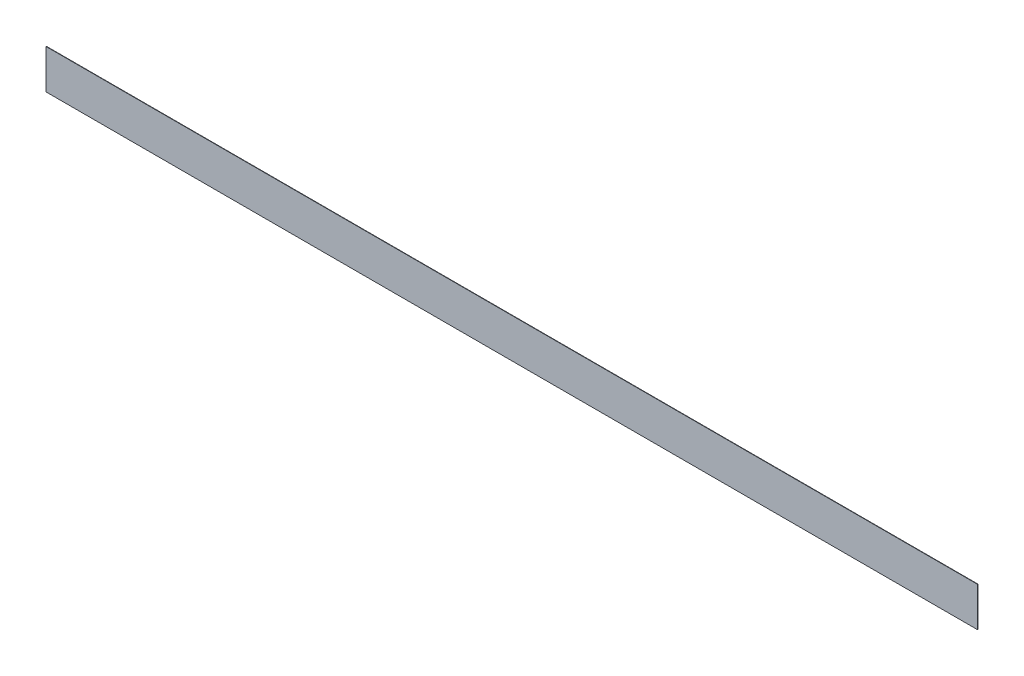
ISO-10303-21;
HEADER;
FILE_DESCRIPTION(('STEP AP214'),'2;1');
FILE_NAME('part.step','',(''),(''),'','','');
FILE_SCHEMA(('AUTOMOTIVE_DESIGN { 1 0 10303 214 1 1 1 1 }'));
ENDSEC;
DATA;
#1=APPLICATION_CONTEXT('core data for automotive mechanical design processes');
#2=APPLICATION_PROTOCOL_DEFINITION('international standard','automotive_design',2000,#1);
#3=PRODUCT_CONTEXT('',#1,'mechanical');
#4=PRODUCT('Part','Part','',(#3));
#5=PRODUCT_RELATED_PRODUCT_CATEGORY('part','',(#4));
#6=PRODUCT_DEFINITION_FORMATION('','',#4);
#7=PRODUCT_DEFINITION_CONTEXT('part definition',#1,'design');
#8=PRODUCT_DEFINITION('design','',#6,#7);
#9=PRODUCT_DEFINITION_SHAPE('','',#8);
#10=(LENGTH_UNIT() NAMED_UNIT(*) SI_UNIT(.MILLI.,.METRE.));
#11=(NAMED_UNIT(*) PLANE_ANGLE_UNIT() SI_UNIT($,.RADIAN.));
#12=(NAMED_UNIT(*) SI_UNIT($,.STERADIAN.) SOLID_ANGLE_UNIT());
#13=UNCERTAINTY_MEASURE_WITH_UNIT(LENGTH_MEASURE(1.E-05),#10,'distance_accuracy_value','');
#14=(GEOMETRIC_REPRESENTATION_CONTEXT(3) GLOBAL_UNCERTAINTY_ASSIGNED_CONTEXT((#13)) GLOBAL_UNIT_ASSIGNED_CONTEXT((#10,
#11,#12)) REPRESENTATION_CONTEXT('',''));
#15=CARTESIAN_POINT('',(0.,0.,0.));
#16=DIRECTION('',(0.,0.,1.));
#17=DIRECTION('',(1.,0.,0.));
#18=AXIS2_PLACEMENT_3D('',#15,#16,#17);
#19=CARTESIAN_POINT('',(0.,0.,0.));
#20=DIRECTION('',(0.,0.,1.));
#21=DIRECTION('',(1.,0.,0.));
#22=AXIS2_PLACEMENT_3D('',#19,#20,#21);
#23=PLANE('',#22);
#24=DIRECTION('',(1.,0.,0.));
#25=VECTOR('',#24,1.);
#26=CARTESIAN_POINT('',(300.6725,12.7,0.));
#27=LINE('',#26,#25);
#28=CARTESIAN_POINT('',(-300.6725,12.7,0.));
#29=VERTEX_POINT('',#28);
#30=CARTESIAN_POINT('',(300.6725,12.7,0.));
#31=VERTEX_POINT('',#30);
#32=EDGE_CURVE('E80',#29,#31,#27,.T.);
#33=ORIENTED_EDGE('',*,*,#32,.T.);
#34=DIRECTION('',(0.,1.,0.));
#35=VECTOR('',#34,1.);
#36=CARTESIAN_POINT('',(300.6725,-12.7,0.));
#37=LINE('',#36,#35);
#38=CARTESIAN_POINT('',(300.6725,-12.7,0.));
#39=VERTEX_POINT('',#38);
#40=EDGE_CURVE('E67',#31,#39,#37,.F.);
#41=ORIENTED_EDGE('',*,*,#40,.T.);
#42=DIRECTION('',(-1.,0.,0.));
#43=VECTOR('',#42,1.);
#44=CARTESIAN_POINT('',(300.6725,-12.7,0.));
#45=LINE('',#44,#43);
#46=CARTESIAN_POINT('',(-300.6725,-12.7,0.));
#47=VERTEX_POINT('',#46);
#48=EDGE_CURVE('E54',#39,#47,#45,.T.);
#49=ORIENTED_EDGE('',*,*,#48,.T.);
#50=DIRECTION('',(0.,1.,0.));
#51=VECTOR('',#50,1.);
#52=CARTESIAN_POINT('',(-300.6725,-12.7,0.));
#53=LINE('',#52,#51);
#54=EDGE_CURVE('E19',#47,#29,#53,.T.);
#55=ORIENTED_EDGE('',*,*,#54,.T.);
#56=EDGE_LOOP('',(#33,#41,#49,#55));
#57=FACE_BOUND('',#56,.T.);
#58=ADVANCED_FACE('F16',(#57),#23,.F.);
#59=CARTESIAN_POINT('',(-300.6725,-12.7,0.254));
#60=DIRECTION('',(1.,0.,0.));
#61=DIRECTION('',(0.,0.,-1.));
#62=AXIS2_PLACEMENT_3D('',#59,#60,#61);
#63=PLANE('',#62);
#64=DIRECTION('',(0.,0.,1.));
#65=VECTOR('',#64,1.);
#66=CARTESIAN_POINT('',(-300.6725,-12.7,0.254));
#67=LINE('',#66,#65);
#68=CARTESIAN_POINT('',(-300.6725,-12.7,0.254));
#69=VERTEX_POINT('',#68);
#70=EDGE_CURVE('E60',#47,#69,#67,.T.);
#71=ORIENTED_EDGE('',*,*,#70,.T.);
#72=DIRECTION('',(0.,1.,0.));
#73=VECTOR('',#72,1.);
#74=CARTESIAN_POINT('',(-300.6725,0.,0.254));
#75=LINE('',#74,#73);
#76=CARTESIAN_POINT('',(-300.6725,12.7,0.254));
#77=VERTEX_POINT('',#76);
#78=EDGE_CURVE('E82',#77,#69,#75,.F.);
#79=ORIENTED_EDGE('',*,*,#78,.F.);
#80=DIRECTION('',(0.,0.,1.));
#81=VECTOR('',#80,1.);
#82=CARTESIAN_POINT('',(-300.6725,12.7,0.254));
#83=LINE('',#82,#81);
#84=EDGE_CURVE('E63',#77,#29,#83,.F.);
#85=ORIENTED_EDGE('',*,*,#84,.T.);
#86=ORIENTED_EDGE('',*,*,#54,.F.);
#87=EDGE_LOOP('',(#71,#79,#85,#86));
#88=FACE_BOUND('',#87,.T.);
#89=ADVANCED_FACE('F59',(#88),#63,.F.);
#90=CARTESIAN_POINT('',(300.6725,-12.7,0.254));
#91=DIRECTION('',(0.,1.,0.));
#92=DIRECTION('',(-1.,0.,0.));
#93=AXIS2_PLACEMENT_3D('',#90,#91,#92);
#94=PLANE('',#93);
#95=DIRECTION('',(0.,0.,1.));
#96=VECTOR('',#95,1.);
#97=CARTESIAN_POINT('',(300.6725,-12.7,0.254));
#98=LINE('',#97,#96);
#99=CARTESIAN_POINT('',(300.6725,-12.7,0.254));
#100=VERTEX_POINT('',#99);
#101=EDGE_CURVE('E69',#39,#100,#98,.T.);
#102=ORIENTED_EDGE('',*,*,#101,.T.);
#103=DIRECTION('',(1.,0.,0.));
#104=VECTOR('',#103,1.);
#105=CARTESIAN_POINT('',(0.,-12.7,0.254));
#106=LINE('',#105,#104);
#107=EDGE_CURVE('E73',#69,#100,#106,.T.);
#108=ORIENTED_EDGE('',*,*,#107,.F.);
#109=ORIENTED_EDGE('',*,*,#70,.F.);
#110=ORIENTED_EDGE('',*,*,#48,.F.);
#111=EDGE_LOOP('',(#102,#108,#109,#110));
#112=FACE_BOUND('',#111,.T.);
#113=ADVANCED_FACE('F71',(#112),#94,.F.);
#114=CARTESIAN_POINT('',(300.6725,-12.7,0.254));
#115=DIRECTION('',(-1.,0.,0.));
#116=DIRECTION('',(0.,0.,1.));
#117=AXIS2_PLACEMENT_3D('',#114,#115,#116);
#118=PLANE('',#117);
#119=DIRECTION('',(0.,0.,1.));
#120=VECTOR('',#119,1.);
#121=CARTESIAN_POINT('',(300.6725,12.7,0.254));
#122=LINE('',#121,#120);
#123=CARTESIAN_POINT('',(300.6725,12.7,0.254));
#124=VERTEX_POINT('',#123);
#125=EDGE_CURVE('E34',#31,#124,#122,.T.);
#126=ORIENTED_EDGE('',*,*,#125,.T.);
#127=DIRECTION('',(0.,1.,0.));
#128=VECTOR('',#127,1.);
#129=CARTESIAN_POINT('',(300.6725,0.,0.254));
#130=LINE('',#129,#128);
#131=EDGE_CURVE('E25',#100,#124,#130,.T.);
#132=ORIENTED_EDGE('',*,*,#131,.F.);
#133=ORIENTED_EDGE('',*,*,#101,.F.);
#134=ORIENTED_EDGE('',*,*,#40,.F.);
#135=EDGE_LOOP('',(#126,#132,#133,#134));
#136=FACE_BOUND('',#135,.T.);
#137=ADVANCED_FACE('F88',(#136),#118,.F.);
#138=CARTESIAN_POINT('',(300.6725,12.7,0.254));
#139=DIRECTION('',(0.,-1.,0.));
#140=DIRECTION('',(1.,0.,0.));
#141=AXIS2_PLACEMENT_3D('',#138,#139,#140);
#142=PLANE('',#141);
#143=ORIENTED_EDGE('',*,*,#84,.F.);
#144=DIRECTION('',(1.,0.,0.));
#145=VECTOR('',#144,1.);
#146=CARTESIAN_POINT('',(0.,12.7,0.254));
#147=LINE('',#146,#145);
#148=EDGE_CURVE('E11',#124,#77,#147,.F.);
#149=ORIENTED_EDGE('',*,*,#148,.F.);
#150=ORIENTED_EDGE('',*,*,#125,.F.);
#151=ORIENTED_EDGE('',*,*,#32,.F.);
#152=EDGE_LOOP('',(#143,#149,#150,#151));
#153=FACE_BOUND('',#152,.T.);
#154=ADVANCED_FACE('F90',(#153),#142,.F.);
#155=CARTESIAN_POINT('',(0.,0.,0.254));
#156=DIRECTION('',(0.,0.,1.));
#157=DIRECTION('',(1.,0.,0.));
#158=AXIS2_PLACEMENT_3D('',#155,#156,#157);
#159=PLANE('',#158);
#160=ORIENTED_EDGE('',*,*,#131,.T.);
#161=ORIENTED_EDGE('',*,*,#148,.T.);
#162=ORIENTED_EDGE('',*,*,#78,.T.);
#163=ORIENTED_EDGE('',*,*,#107,.T.);
#164=EDGE_LOOP('',(#160,#161,#162,#163));
#165=FACE_BOUND('',#164,.T.);
#166=ADVANCED_FACE('F87',(#165),#159,.T.);
#167=CLOSED_SHELL('',(#58,#89,#113,#137,#154,#166));
#168=MANIFOLD_SOLID_BREP('B1',#167);
#169=ADVANCED_BREP_SHAPE_REPRESENTATION('',(#18,#168),#14);
#170=SHAPE_DEFINITION_REPRESENTATION(#9,#169);
ENDSEC;
END-ISO-10303-21;
